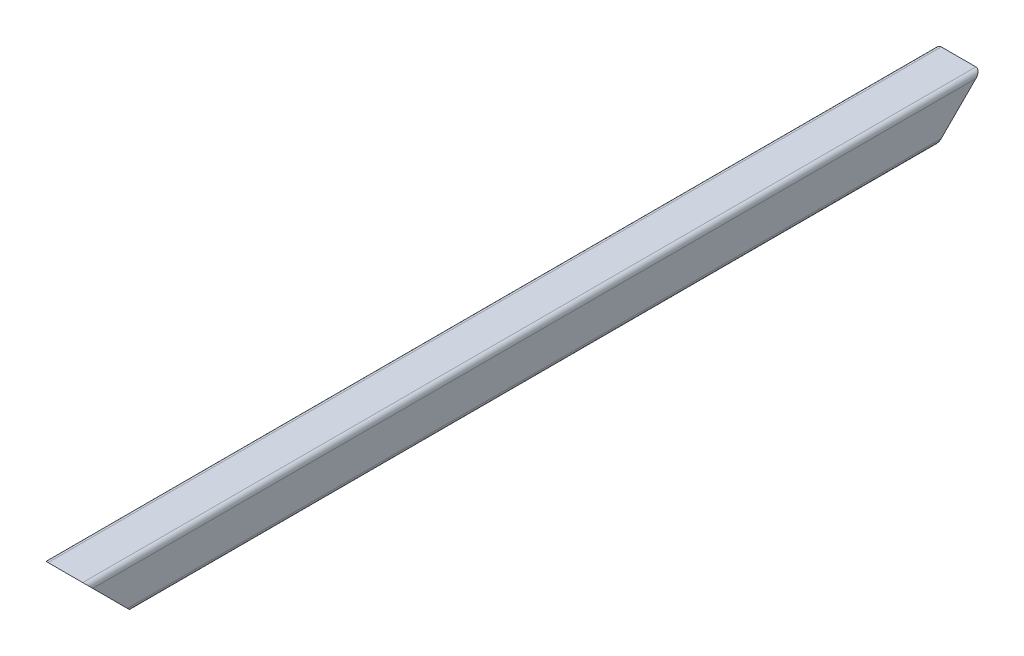
ISO-10303-21;
HEADER;
FILE_DESCRIPTION(('STEP AP214'),'2;1');
FILE_NAME('part.step','',(''),(''),'','','');
FILE_SCHEMA(('AUTOMOTIVE_DESIGN { 1 0 10303 214 1 1 1 1 }'));
ENDSEC;
DATA;
#1=APPLICATION_CONTEXT('core data for automotive mechanical design processes');
#2=APPLICATION_PROTOCOL_DEFINITION('international standard','automotive_design',2000,#1);
#3=PRODUCT_CONTEXT('',#1,'mechanical');
#4=PRODUCT('Part','Part','',(#3));
#5=PRODUCT_RELATED_PRODUCT_CATEGORY('part','',(#4));
#6=PRODUCT_DEFINITION_FORMATION('','',#4);
#7=PRODUCT_DEFINITION_CONTEXT('part definition',#1,'design');
#8=PRODUCT_DEFINITION('design','',#6,#7);
#9=PRODUCT_DEFINITION_SHAPE('','',#8);
#10=(LENGTH_UNIT() NAMED_UNIT(*) SI_UNIT(.MILLI.,.METRE.));
#11=(NAMED_UNIT(*) PLANE_ANGLE_UNIT() SI_UNIT($,.RADIAN.));
#12=(NAMED_UNIT(*) SI_UNIT($,.STERADIAN.) SOLID_ANGLE_UNIT());
#13=UNCERTAINTY_MEASURE_WITH_UNIT(LENGTH_MEASURE(1.E-05),#10,'distance_accuracy_value','');
#14=(GEOMETRIC_REPRESENTATION_CONTEXT(3) GLOBAL_UNCERTAINTY_ASSIGNED_CONTEXT((#13)) GLOBAL_UNIT_ASSIGNED_CONTEXT((#10,
#11,#12)) REPRESENTATION_CONTEXT('',''));
#15=CARTESIAN_POINT('',(0.,0.,0.));
#16=DIRECTION('',(0.,0.,1.));
#17=DIRECTION('',(1.,0.,0.));
#18=AXIS2_PLACEMENT_3D('',#15,#16,#17);
#19=CARTESIAN_POINT('',(-15.4999999999997,1444.50000000001,-759.999999999998));
#20=DIRECTION('',(0.,0.,0.999999999999995));
#21=DIRECTION('',(0.999999999999999,0.,0.));
#22=AXIS2_PLACEMENT_3D('',#19,#20,#21);
#23=CYLINDRICAL_SURFACE('',#22,4.5);
#24=CARTESIAN_POINT('',(-15.5,1444.50000000001,-15.4999999999986));
#25=DIRECTION('',(0.,-0.707106781186555,0.707106781186545));
#26=DIRECTION('',(0.,0.707106781186554,0.707106781186544));
#27=AXIS2_PLACEMENT_3D('',#24,#25,#26);
#28=ELLIPSE('',#27,6.36396103067893,4.5);
#29=CARTESIAN_POINT('',(-19.9999999999989,1444.50000000001,-15.4999999999981));
#30=VERTEX_POINT('',#29);
#31=CARTESIAN_POINT('',(-15.4999999999991,1440.00000000001,-19.9999999999986));
#32=VERTEX_POINT('',#31);
#33=EDGE_CURVE('E170',#30,#32,#28,.T.);
#34=ORIENTED_EDGE('',*,*,#33,.F.);
#35=DIRECTION('',(0.,0.,0.999999999999995));
#36=VECTOR('',#35,1.);
#37=CARTESIAN_POINT('',(-19.9999999999998,1444.50000000001,-759.999999999997));
#38=LINE('',#37,#36);
#39=CARTESIAN_POINT('',(-20.0000000000003,1444.50000000002,-744.499999999996));
#40=VERTEX_POINT('',#39);
#41=EDGE_CURVE('E58',#40,#30,#38,.T.);
#42=ORIENTED_EDGE('',*,*,#41,.F.);
#43=CARTESIAN_POINT('',(-15.5000000000002,1444.50000000001,-744.499999999996));
#44=DIRECTION('',(0.,-0.707106781186554,-0.707106781186545));
#45=DIRECTION('',(0.,-0.707106781186555,0.707106781186545));
#46=AXIS2_PLACEMENT_3D('',#43,#44,#45);
#47=ELLIPSE('',#46,6.36396103067893,4.5);
#48=CARTESIAN_POINT('',(-15.4999999999984,1440.00000000001,-739.999999999995));
#49=VERTEX_POINT('',#48);
#50=EDGE_CURVE('E187',#49,#40,#47,.T.);
#51=ORIENTED_EDGE('',*,*,#50,.F.);
#52=DIRECTION('',(0.,0.,0.999999999999995));
#53=VECTOR('',#52,1.);
#54=CARTESIAN_POINT('',(-15.4999999999982,1440.00000000001,-759.999999999996));
#55=LINE('',#54,#53);
#56=EDGE_CURVE('E212',#49,#32,#55,.T.);
#57=ORIENTED_EDGE('',*,*,#56,.T.);
#58=EDGE_LOOP('',(#34,#42,#51,#57));
#59=FACE_BOUND('',#58,.T.);
#60=ADVANCED_FACE('F43',(#59),#23,.T.);
#61=CARTESIAN_POINT('',(-19.9999999999998,1444.50000000001,-759.999999999997));
#62=DIRECTION('',(0.999999999999999,0.,0.));
#63=DIRECTION('',(0.,0.,-0.999999999999995));
#64=AXIS2_PLACEMENT_3D('',#61,#62,#63);
#65=PLANE('',#64);
#66=DIRECTION('',(0.,-0.707106781186554,-0.707106781186544));
#67=VECTOR('',#66,1.);
#68=CARTESIAN_POINT('',(-19.9999999999999,1072.25000000001,-387.749999999997));
#69=LINE('',#68,#67);
#70=CARTESIAN_POINT('',(-20.0000000000011,1475.50000000002,15.5000000000001));
#71=VERTEX_POINT('',#70);
#72=EDGE_CURVE('E265',#71,#30,#69,.T.);
#73=ORIENTED_EDGE('',*,*,#72,.F.);
#74=DIRECTION('',(0.,0.,0.999999999999995));
#75=VECTOR('',#74,1.);
#76=CARTESIAN_POINT('',(-20.0000000000016,1475.50000000001,-759.999999999996));
#77=LINE('',#76,#75);
#78=CARTESIAN_POINT('',(-20.0000000000005,1475.50000000001,-775.499999999998));
#79=VERTEX_POINT('',#78);
#80=EDGE_CURVE('E184',#79,#71,#77,.T.);
#81=ORIENTED_EDGE('',*,*,#80,.F.);
#82=DIRECTION('',(0.,0.707106781186555,-0.707106781186545));
#83=VECTOR('',#82,1.);
#84=CARTESIAN_POINT('',(-20.0000000000004,1452.25000000001,-752.249999999998));
#85=LINE('',#84,#83);
#86=EDGE_CURVE('E335',#40,#79,#85,.T.);
#87=ORIENTED_EDGE('',*,*,#86,.F.);
#88=ORIENTED_EDGE('',*,*,#41,.T.);
#89=EDGE_LOOP('',(#73,#81,#87,#88));
#90=FACE_BOUND('',#89,.T.);
#91=ADVANCED_FACE('F347',(#90),#65,.F.);
#92=CARTESIAN_POINT('',(-15.5000000000013,1475.50000000001,-759.999999999998));
#93=DIRECTION('',(0.,0.,0.999999999999995));
#94=DIRECTION('',(0.999999999999999,0.,0.));
#95=AXIS2_PLACEMENT_3D('',#92,#93,#94);
#96=CYLINDRICAL_SURFACE('',#95,4.5);
#97=CARTESIAN_POINT('',(-15.5000000000002,1475.50000000001,15.5000000000018));
#98=DIRECTION('',(0.,-0.707106781186555,0.707106781186545));
#99=DIRECTION('',(0.,0.707106781186554,0.707106781186544));
#100=AXIS2_PLACEMENT_3D('',#97,#98,#99);
#101=ELLIPSE('',#100,6.36396103067893,4.5);
#102=CARTESIAN_POINT('',(-15.5,1480.00000000001,20.0000000000006));
#103=VERTEX_POINT('',#102);
#104=EDGE_CURVE('E269',#103,#71,#101,.T.);
#105=ORIENTED_EDGE('',*,*,#104,.F.);
#106=DIRECTION('',(0.,0.,0.999999999999995));
#107=VECTOR('',#106,1.);
#108=CARTESIAN_POINT('',(-15.5000000000022,1480.,-759.999999999993));
#109=LINE('',#108,#107);
#110=CARTESIAN_POINT('',(-15.5000000000011,1480.00000000001,-779.999999999994));
#111=VERTEX_POINT('',#110);
#112=EDGE_CURVE('E231',#111,#103,#109,.T.);
#113=ORIENTED_EDGE('',*,*,#112,.F.);
#114=CARTESIAN_POINT('',(-15.5000000000002,1475.50000000001,-775.499999999997));
#115=DIRECTION('',(0.,-0.707106781186554,-0.707106781186545));
#116=DIRECTION('',(0.,-0.707106781186555,0.707106781186545));
#117=AXIS2_PLACEMENT_3D('',#114,#115,#116);
#118=ELLIPSE('',#117,6.36396103067893,4.5);
#119=EDGE_CURVE('E332',#79,#111,#118,.T.);
#120=ORIENTED_EDGE('',*,*,#119,.F.);
#121=ORIENTED_EDGE('',*,*,#80,.T.);
#122=EDGE_LOOP('',(#105,#113,#120,#121));
#123=FACE_BOUND('',#122,.T.);
#124=ADVANCED_FACE('F349',(#123),#96,.T.);
#125=CARTESIAN_POINT('',(-15.5000000000022,1480.,-759.999999999993));
#126=DIRECTION('',(0.,-1.00000000000001,0.));
#127=DIRECTION('',(0.,0.,-0.999999999999995));
#128=AXIS2_PLACEMENT_3D('',#125,#126,#127);
#129=PLANE('',#128);
#130=DIRECTION('',(-0.999999999999999,0.,0.));
#131=VECTOR('',#130,1.);
#132=CARTESIAN_POINT('',(-15.5,1480.00000000001,20.0000000000006));
#133=LINE('',#132,#131);
#134=CARTESIAN_POINT('',(15.5000000000009,1480.00000000001,20.0000000000001));
#135=VERTEX_POINT('',#134);
#136=EDGE_CURVE('E273',#135,#103,#133,.T.);
#137=ORIENTED_EDGE('',*,*,#136,.F.);
#138=DIRECTION('',(0.,0.,0.999999999999995));
#139=VECTOR('',#138,1.);
#140=CARTESIAN_POINT('',(15.4999999999987,1480.00000000001,-759.999999999994));
#141=LINE('',#140,#139);
#142=CARTESIAN_POINT('',(15.499999999998,1480.00000000001,-779.999999999992));
#143=VERTEX_POINT('',#142);
#144=EDGE_CURVE('E227',#143,#135,#141,.T.);
#145=ORIENTED_EDGE('',*,*,#144,.F.);
#146=DIRECTION('',(0.999999999999999,0.,0.));
#147=VECTOR('',#146,1.);
#148=CARTESIAN_POINT('',(-15.5000000000011,1480.00000000001,-779.999999999994));
#149=LINE('',#148,#147);
#150=EDGE_CURVE('E328',#111,#143,#149,.T.);
#151=ORIENTED_EDGE('',*,*,#150,.F.);
#152=ORIENTED_EDGE('',*,*,#112,.T.);
#153=EDGE_LOOP('',(#137,#145,#151,#152));
#154=FACE_BOUND('',#153,.T.);
#155=ADVANCED_FACE('F353',(#154),#129,.F.);
#156=CARTESIAN_POINT('',(15.4999999999969,1475.50000000001,-759.999999999997));
#157=DIRECTION('',(0.,0.,0.999999999999995));
#158=DIRECTION('',(0.999999999999999,0.,0.));
#159=AXIS2_PLACEMENT_3D('',#156,#157,#158);
#160=CYLINDRICAL_SURFACE('',#159,4.5);
#161=CARTESIAN_POINT('',(15.5,1475.50000000001,15.4999999999998));
#162=DIRECTION('',(0.,-0.707106781186555,0.707106781186545));
#163=DIRECTION('',(0.,0.707106781186554,0.707106781186544));
#164=AXIS2_PLACEMENT_3D('',#161,#162,#163);
#165=ELLIPSE('',#164,6.36396103067893,4.5);
#166=CARTESIAN_POINT('',(20.0000000000007,1475.50000000001,15.5000000000005));
#167=VERTEX_POINT('',#166);
#168=EDGE_CURVE('E277',#167,#135,#165,.T.);
#169=ORIENTED_EDGE('',*,*,#168,.F.);
#170=DIRECTION('',(0.,0.,0.999999999999995));
#171=VECTOR('',#170,1.);
#172=CARTESIAN_POINT('',(19.9999999999993,1475.50000000001,-759.999999999998));
#173=LINE('',#172,#171);
#174=CARTESIAN_POINT('',(19.9999999999991,1475.50000000001,-775.499999999996));
#175=VERTEX_POINT('',#174);
#176=EDGE_CURVE('E223',#175,#167,#173,.T.);
#177=ORIENTED_EDGE('',*,*,#176,.F.);
#178=CARTESIAN_POINT('',(15.499999999998,1475.50000000001,-775.499999999998));
#179=DIRECTION('',(0.,-0.707106781186554,-0.707106781186545));
#180=DIRECTION('',(0.,-0.707106781186555,0.707106781186545));
#181=AXIS2_PLACEMENT_3D('',#178,#179,#180);
#182=ELLIPSE('',#181,6.36396103067893,4.5);
#183=EDGE_CURVE('E324',#143,#175,#182,.T.);
#184=ORIENTED_EDGE('',*,*,#183,.F.);
#185=ORIENTED_EDGE('',*,*,#144,.T.);
#186=EDGE_LOOP('',(#169,#177,#184,#185));
#187=FACE_BOUND('',#186,.T.);
#188=ADVANCED_FACE('F355',(#187),#160,.T.);
#189=CARTESIAN_POINT('',(20.,1444.50000000001,-759.999999999996));
#190=DIRECTION('',(-0.999999999999999,0.,0.));
#191=DIRECTION('',(0.,0.,0.999999999999995));
#192=AXIS2_PLACEMENT_3D('',#189,#190,#191);
#193=PLANE('',#192);
#194=DIRECTION('',(0.,0.707106781186554,0.707106781186544));
#195=VECTOR('',#194,1.);
#196=CARTESIAN_POINT('',(20.0000000000003,1072.25000000001,-387.749999999997));
#197=LINE('',#196,#195);
#198=CARTESIAN_POINT('',(20.0000000000007,1444.50000000001,-15.4999999999988));
#199=VERTEX_POINT('',#198);
#200=EDGE_CURVE('E281',#199,#167,#197,.T.);
#201=ORIENTED_EDGE('',*,*,#200,.F.);
#202=DIRECTION('',(0.,0.,0.999999999999995));
#203=VECTOR('',#202,1.);
#204=CARTESIAN_POINT('',(20.,1444.50000000001,-759.999999999996));
#205=LINE('',#204,#203);
#206=CARTESIAN_POINT('',(19.9999999999993,1444.50000000001,-744.499999999995));
#207=VERTEX_POINT('',#206);
#208=EDGE_CURVE('E219',#207,#199,#205,.T.);
#209=ORIENTED_EDGE('',*,*,#208,.F.);
#210=DIRECTION('',(0.,-0.707106781186555,0.707106781186545));
#211=VECTOR('',#210,1.);
#212=CARTESIAN_POINT('',(20.0000000000011,1452.25000000001,-752.249999999995));
#213=LINE('',#212,#211);
#214=EDGE_CURVE('E320',#175,#207,#213,.T.);
#215=ORIENTED_EDGE('',*,*,#214,.F.);
#216=ORIENTED_EDGE('',*,*,#176,.T.);
#217=EDGE_LOOP('',(#201,#209,#215,#216));
#218=FACE_BOUND('',#217,.T.);
#219=ADVANCED_FACE('F359',(#218),#193,.F.);
#220=CARTESIAN_POINT('',(15.5000000000011,1444.50000000001,-759.999999999995));
#221=DIRECTION('',(0.,0.,0.999999999999995));
#222=DIRECTION('',(0.999999999999999,0.,0.));
#223=AXIS2_PLACEMENT_3D('',#220,#221,#222);
#224=CYLINDRICAL_SURFACE('',#223,4.5);
#225=CARTESIAN_POINT('',(15.4999999999999,1444.50000000001,-15.5000000000004));
#226=DIRECTION('',(0.,-0.707106781186555,0.707106781186545));
#227=DIRECTION('',(0.,0.707106781186554,0.707106781186544));
#228=AXIS2_PLACEMENT_3D('',#225,#226,#227);
#229=ELLIPSE('',#228,6.36396103067893,4.5);
#230=CARTESIAN_POINT('',(15.4999999999984,1440.00000000001,-19.9999999999992));
#231=VERTEX_POINT('',#230);
#232=EDGE_CURVE('E285',#231,#199,#229,.T.);
#233=ORIENTED_EDGE('',*,*,#232,.F.);
#234=DIRECTION('',(0.,0.,0.999999999999995));
#235=VECTOR('',#234,1.);
#236=CARTESIAN_POINT('',(15.4999999999993,1440.00000000001,-759.999999999996));
#237=LINE('',#236,#235);
#238=CARTESIAN_POINT('',(15.5000000000004,1440.00000000001,-739.999999999996));
#239=VERTEX_POINT('',#238);
#240=EDGE_CURVE('E215',#239,#231,#237,.T.);
#241=ORIENTED_EDGE('',*,*,#240,.F.);
#242=CARTESIAN_POINT('',(15.5000000000004,1444.50000000001,-744.499999999995));
#243=DIRECTION('',(0.,-0.707106781186554,-0.707106781186545));
#244=DIRECTION('',(0.,-0.707106781186555,0.707106781186545));
#245=AXIS2_PLACEMENT_3D('',#242,#243,#244);
#246=ELLIPSE('',#245,6.36396103067893,4.5);
#247=EDGE_CURVE('E316',#207,#239,#246,.T.);
#248=ORIENTED_EDGE('',*,*,#247,.F.);
#249=ORIENTED_EDGE('',*,*,#208,.T.);
#250=EDGE_LOOP('',(#233,#241,#248,#249));
#251=FACE_BOUND('',#250,.T.);
#252=ADVANCED_FACE('F361',(#251),#224,.T.);
#253=CARTESIAN_POINT('',(-15.4999999999982,1440.00000000001,-759.999999999996));
#254=DIRECTION('',(0.,1.00000000000001,0.));
#255=DIRECTION('',(0.,0.,0.999999999999995));
#256=AXIS2_PLACEMENT_3D('',#253,#254,#255);
#257=PLANE('',#256);
#258=DIRECTION('',(0.999999999999999,0.,0.));
#259=VECTOR('',#258,1.);
#260=CARTESIAN_POINT('',(-15.4999999999991,1440.00000000001,-19.9999999999986));
#261=LINE('',#260,#259);
#262=EDGE_CURVE('E249',#32,#231,#261,.T.);
#263=ORIENTED_EDGE('',*,*,#262,.F.);
#264=ORIENTED_EDGE('',*,*,#56,.F.);
#265=DIRECTION('',(-0.999999999999999,0.,0.));
#266=VECTOR('',#265,1.);
#267=CARTESIAN_POINT('',(-15.4999999999984,1440.00000000001,-739.999999999995));
#268=LINE('',#267,#266);
#269=EDGE_CURVE('E312',#239,#49,#268,.T.);
#270=ORIENTED_EDGE('',*,*,#269,.F.);
#271=ORIENTED_EDGE('',*,*,#240,.T.);
#272=EDGE_LOOP('',(#263,#264,#270,#271));
#273=FACE_BOUND('',#272,.T.);
#274=ADVANCED_FACE('F363',(#273),#257,.F.);
#275=CARTESIAN_POINT('',(-1.11159442390632E-12,1460.00000000001,-759.999999999995));
#276=DIRECTION('',(0.,-0.707106781186554,-0.707106781186545));
#277=DIRECTION('',(0.,0.707106781186555,-0.707106781186545));
#278=AXIS2_PLACEMENT_3D('',#275,#276,#277);
#279=PLANE('',#278);
#280=CARTESIAN_POINT('',(-15.,1445.00000000001,-744.999999999997));
#281=DIRECTION('',(0.,-0.707106781186554,-0.707106781186545));
#282=DIRECTION('',(0.,-0.707106781186555,0.707106781186545));
#283=AXIS2_PLACEMENT_3D('',#280,#281,#282);
#284=ELLIPSE('',#283,4.24264068711928,3.);
#285=CARTESIAN_POINT('',(-14.9999999999998,1442.00000000001,-741.999999999996));
#286=VERTEX_POINT('',#285);
#287=CARTESIAN_POINT('',(-18.0000000000004,1445.00000000001,-744.999999999998));
#288=VERTEX_POINT('',#287);
#289=EDGE_CURVE('E175',#286,#288,#284,.T.);
#290=ORIENTED_EDGE('',*,*,#289,.F.);
#291=DIRECTION('',(-0.999999999999999,0.,0.));
#292=VECTOR('',#291,1.);
#293=CARTESIAN_POINT('',(-14.9999999999998,1442.00000000001,-741.999999999996));
#294=LINE('',#293,#292);
#295=CARTESIAN_POINT('',(15.,1442.00000000001,-741.999999999996));
#296=VERTEX_POINT('',#295);
#297=EDGE_CURVE('E306',#296,#286,#294,.T.);
#298=ORIENTED_EDGE('',*,*,#297,.F.);
#299=CARTESIAN_POINT('',(15.0000000000003,1445.00000000001,-744.999999999997));
#300=DIRECTION('',(0.,-0.707106781186554,-0.707106781186545));
#301=DIRECTION('',(0.,-0.707106781186555,0.707106781186545));
#302=AXIS2_PLACEMENT_3D('',#299,#300,#301);
#303=ELLIPSE('',#302,4.24264068711928,3.);
#304=CARTESIAN_POINT('',(18.0000000000019,1445.00000000001,-744.999999999997));
#305=VERTEX_POINT('',#304);
#306=EDGE_CURVE('E302',#305,#296,#303,.T.);
#307=ORIENTED_EDGE('',*,*,#306,.F.);
#308=DIRECTION('',(0.,-0.707106781186555,0.707106781186545));
#309=VECTOR('',#308,1.);
#310=CARTESIAN_POINT('',(17.9999999999995,1452.50000000001,-752.499999999995));
#311=LINE('',#310,#309);
#312=CARTESIAN_POINT('',(18.0000000000002,1475.00000000001,-774.999999999997));
#313=VERTEX_POINT('',#312);
#314=EDGE_CURVE('E298',#313,#305,#311,.T.);
#315=ORIENTED_EDGE('',*,*,#314,.F.);
#316=CARTESIAN_POINT('',(14.9999999999969,1475.00000000001,-774.999999999996));
#317=DIRECTION('',(0.,-0.707106781186554,-0.707106781186545));
#318=DIRECTION('',(0.,-0.707106781186555,0.707106781186545));
#319=AXIS2_PLACEMENT_3D('',#316,#317,#318);
#320=ELLIPSE('',#319,4.24264068711928,3.);
#321=CARTESIAN_POINT('',(14.9999999999987,1478.00000000001,-777.999999999995));
#322=VERTEX_POINT('',#321);
#323=EDGE_CURVE('E294',#322,#313,#320,.T.);
#324=ORIENTED_EDGE('',*,*,#323,.F.);
#325=DIRECTION('',(0.999999999999999,0.,0.));
#326=VECTOR('',#325,1.);
#327=CARTESIAN_POINT('',(-15.,1478.00000000001,-777.999999999994));
#328=LINE('',#327,#326);
#329=CARTESIAN_POINT('',(-15.,1478.00000000001,-777.999999999994));
#330=VERTEX_POINT('',#329);
#331=EDGE_CURVE('E245',#330,#322,#328,.T.);
#332=ORIENTED_EDGE('',*,*,#331,.F.);
#333=CARTESIAN_POINT('',(-15.,1475.00000000001,-774.999999999996));
#334=DIRECTION('',(0.,-0.707106781186554,-0.707106781186545));
#335=DIRECTION('',(0.,-0.707106781186555,0.707106781186545));
#336=AXIS2_PLACEMENT_3D('',#333,#334,#335);
#337=ELLIPSE('',#336,4.24264068711928,3.);
#338=CARTESIAN_POINT('',(-18.0000000000021,1475.00000000001,-774.999999999998));
#339=VERTEX_POINT('',#338);
#340=EDGE_CURVE('E243',#339,#330,#337,.T.);
#341=ORIENTED_EDGE('',*,*,#340,.F.);
#342=DIRECTION('',(0.,0.707106781186555,-0.707106781186545));
#343=VECTOR('',#342,1.);
#344=CARTESIAN_POINT('',(-17.9999999999986,1452.50000000001,-752.499999999995));
#345=LINE('',#344,#343);
#346=EDGE_CURVE('E51',#288,#339,#345,.T.);
#347=ORIENTED_EDGE('',*,*,#346,.F.);
#348=EDGE_LOOP('',(#290,#298,#307,#315,#324,#332,#341,#347));
#349=FACE_BOUND('',#348,.T.);
#350=ORIENTED_EDGE('',*,*,#269,.T.);
#351=ORIENTED_EDGE('',*,*,#50,.T.);
#352=ORIENTED_EDGE('',*,*,#86,.T.);
#353=ORIENTED_EDGE('',*,*,#119,.T.);
#354=ORIENTED_EDGE('',*,*,#150,.T.);
#355=ORIENTED_EDGE('',*,*,#183,.T.);
#356=ORIENTED_EDGE('',*,*,#214,.T.);
#357=ORIENTED_EDGE('',*,*,#247,.T.);
#358=EDGE_LOOP('',(#350,#351,#352,#353,#354,#355,#356,#357));
#359=FACE_BOUND('',#358,.T.);
#360=ADVANCED_FACE('F240',(#349,#359),#279,.T.);
#361=CARTESIAN_POINT('',(-15.0000000000005,1445.00000000001,-759.999999999997));
#362=DIRECTION('',(0.,0.,0.999999999999995));
#363=DIRECTION('',(0.999999999999999,0.,0.));
#364=AXIS2_PLACEMENT_3D('',#361,#362,#363);
#365=CYLINDRICAL_SURFACE('',#364,3.);
#366=DIRECTION('',(0.,0.,0.999999999999995));
#367=VECTOR('',#366,1.);
#368=CARTESIAN_POINT('',(-17.9999999999999,1445.00000000001,-759.999999999997));
#369=LINE('',#368,#367);
#370=CARTESIAN_POINT('',(-17.9999999999997,1445.00000000001,-14.9999999999985));
#371=VERTEX_POINT('',#370);
#372=EDGE_CURVE('E165',#288,#371,#369,.T.);
#373=ORIENTED_EDGE('',*,*,#372,.T.);
#374=CARTESIAN_POINT('',(-14.9999999999989,1445.00000000001,-15.));
#375=DIRECTION('',(0.,-0.707106781186555,0.707106781186545));
#376=DIRECTION('',(0.,0.707106781186554,0.707106781186544));
#377=AXIS2_PLACEMENT_3D('',#374,#375,#376);
#378=ELLIPSE('',#377,4.24264068711928,3.);
#379=CARTESIAN_POINT('',(-14.9999999999996,1442.00000000001,-17.999999999998));
#380=VERTEX_POINT('',#379);
#381=EDGE_CURVE('E11',#371,#380,#378,.T.);
#382=ORIENTED_EDGE('',*,*,#381,.T.);
#383=DIRECTION('',(0.,0.,0.999999999999995));
#384=VECTOR('',#383,1.);
#385=CARTESIAN_POINT('',(-15.0000000000013,1442.00000000001,-759.999999999994));
#386=LINE('',#385,#384);
#387=EDGE_CURVE('E209',#286,#380,#386,.T.);
#388=ORIENTED_EDGE('',*,*,#387,.F.);
#389=ORIENTED_EDGE('',*,*,#289,.T.);
#390=EDGE_LOOP('',(#373,#382,#388,#389));
#391=FACE_BOUND('',#390,.T.);
#392=ADVANCED_FACE('F174',(#391),#365,.F.);
#393=CARTESIAN_POINT('',(-15.0000000000013,1442.00000000001,-759.999999999994));
#394=DIRECTION('',(0.,1.00000000000001,0.));
#395=DIRECTION('',(0.,0.,0.999999999999995));
#396=AXIS2_PLACEMENT_3D('',#393,#394,#395);
#397=PLANE('',#396);
#398=ORIENTED_EDGE('',*,*,#387,.T.);
#399=DIRECTION('',(0.999999999999999,0.,0.));
#400=VECTOR('',#399,1.);
#401=CARTESIAN_POINT('',(-14.9999999999996,1442.00000000001,-17.999999999998));
#402=LINE('',#401,#400);
#403=CARTESIAN_POINT('',(15.0000000000009,1442.00000000001,-18.0000000000005));
#404=VERTEX_POINT('',#403);
#405=EDGE_CURVE('E66',#380,#404,#402,.T.);
#406=ORIENTED_EDGE('',*,*,#405,.T.);
#407=DIRECTION('',(0.,0.,0.999999999999995));
#408=VECTOR('',#407,1.);
#409=CARTESIAN_POINT('',(14.9999999999998,1442.00000000001,-759.999999999995));
#410=LINE('',#409,#408);
#411=EDGE_CURVE('E205',#296,#404,#410,.T.);
#412=ORIENTED_EDGE('',*,*,#411,.F.);
#413=ORIENTED_EDGE('',*,*,#297,.T.);
#414=EDGE_LOOP('',(#398,#406,#412,#413));
#415=FACE_BOUND('',#414,.T.);
#416=ADVANCED_FACE('F422',(#415),#397,.T.);
#417=CARTESIAN_POINT('',(15.0000000000009,1445.00000000001,-759.999999999996));
#418=DIRECTION('',(0.,0.,0.999999999999995));
#419=DIRECTION('',(0.999999999999999,0.,0.));
#420=AXIS2_PLACEMENT_3D('',#417,#418,#419);
#421=CYLINDRICAL_SURFACE('',#420,3.);
#422=ORIENTED_EDGE('',*,*,#411,.T.);
#423=CARTESIAN_POINT('',(14.9999999999987,1445.00000000001,-14.9999999999979));
#424=DIRECTION('',(0.,-0.707106781186555,0.707106781186545));
#425=DIRECTION('',(0.,0.707106781186554,0.707106781186544));
#426=AXIS2_PLACEMENT_3D('',#423,#424,#425);
#427=ELLIPSE('',#426,4.24264068711928,3.);
#428=CARTESIAN_POINT('',(18.,1445.00000000001,-14.9999999999993));
#429=VERTEX_POINT('',#428);
#430=EDGE_CURVE('E488',#404,#429,#427,.T.);
#431=ORIENTED_EDGE('',*,*,#430,.T.);
#432=DIRECTION('',(0.,0.,0.999999999999995));
#433=VECTOR('',#432,1.);
#434=CARTESIAN_POINT('',(18.0000000000015,1445.00000000001,-759.999999999995));
#435=LINE('',#434,#433);
#436=EDGE_CURVE('E201',#305,#429,#435,.T.);
#437=ORIENTED_EDGE('',*,*,#436,.F.);
#438=ORIENTED_EDGE('',*,*,#306,.T.);
#439=EDGE_LOOP('',(#422,#431,#437,#438));
#440=FACE_BOUND('',#439,.T.);
#441=ADVANCED_FACE('F428',(#440),#421,.F.);
#442=CARTESIAN_POINT('',(18.0000000000015,1445.00000000001,-759.999999999995));
#443=DIRECTION('',(-0.999999999999999,0.,0.));
#444=DIRECTION('',(0.,0.,0.999999999999995));
#445=AXIS2_PLACEMENT_3D('',#442,#443,#444);
#446=PLANE('',#445);
#447=ORIENTED_EDGE('',*,*,#436,.T.);
#448=DIRECTION('',(0.,0.707106781186554,0.707106781186544));
#449=VECTOR('',#448,1.);
#450=CARTESIAN_POINT('',(17.9999999999975,1072.50000000001,-387.499999999996));
#451=LINE('',#450,#449);
#452=CARTESIAN_POINT('',(17.9999999999997,1475.00000000001,15.0000000000011));
#453=VERTEX_POINT('',#452);
#454=EDGE_CURVE('E485',#429,#453,#451,.T.);
#455=ORIENTED_EDGE('',*,*,#454,.T.);
#456=DIRECTION('',(0.,0.,0.999999999999995));
#457=VECTOR('',#456,1.);
#458=CARTESIAN_POINT('',(17.9999999999973,1475.00000000001,-759.999999999996));
#459=LINE('',#458,#457);
#460=EDGE_CURVE('E197',#313,#453,#459,.T.);
#461=ORIENTED_EDGE('',*,*,#460,.F.);
#462=ORIENTED_EDGE('',*,*,#314,.T.);
#463=EDGE_LOOP('',(#447,#455,#461,#462));
#464=FACE_BOUND('',#463,.T.);
#465=ADVANCED_FACE('F436',(#464),#446,.T.);
#466=CARTESIAN_POINT('',(14.9999999999985,1475.00000000001,-759.999999999998));
#467=DIRECTION('',(0.,0.,0.999999999999995));
#468=DIRECTION('',(0.999999999999999,0.,0.));
#469=AXIS2_PLACEMENT_3D('',#466,#467,#468);
#470=CYLINDRICAL_SURFACE('',#469,3.);
#471=ORIENTED_EDGE('',*,*,#460,.T.);
#472=CARTESIAN_POINT('',(15.0000000000007,1475.00000000001,15.0000000000016));
#473=DIRECTION('',(0.,-0.707106781186555,0.707106781186545));
#474=DIRECTION('',(0.,0.707106781186554,0.707106781186544));
#475=AXIS2_PLACEMENT_3D('',#472,#473,#474);
#476=ELLIPSE('',#475,4.24264068711928,3.);
#477=CARTESIAN_POINT('',(14.9999999999996,1478.00000000001,18.0000000000001));
#478=VERTEX_POINT('',#477);
#479=EDGE_CURVE('E258',#453,#478,#476,.T.);
#480=ORIENTED_EDGE('',*,*,#479,.T.);
#481=DIRECTION('',(0.,0.,0.999999999999995));
#482=VECTOR('',#481,1.);
#483=CARTESIAN_POINT('',(14.9999999999978,1478.,-759.999999999993));
#484=LINE('',#483,#482);
#485=EDGE_CURVE('E193',#322,#478,#484,.T.);
#486=ORIENTED_EDGE('',*,*,#485,.F.);
#487=ORIENTED_EDGE('',*,*,#323,.T.);
#488=EDGE_LOOP('',(#471,#480,#486,#487));
#489=FACE_BOUND('',#488,.T.);
#490=ADVANCED_FACE('F444',(#489),#470,.F.);
#491=CARTESIAN_POINT('',(-15.0000000000022,1478.00000000001,-759.999999999994));
#492=DIRECTION('',(0.,-1.00000000000001,0.));
#493=DIRECTION('',(0.,0.,-0.999999999999995));
#494=AXIS2_PLACEMENT_3D('',#491,#492,#493);
#495=PLANE('',#494);
#496=ORIENTED_EDGE('',*,*,#485,.T.);
#497=DIRECTION('',(-0.999999999999999,0.,0.));
#498=VECTOR('',#497,1.);
#499=CARTESIAN_POINT('',(-15.0000000000007,1478.00000000001,18.0000000000008));
#500=LINE('',#499,#498);
#501=CARTESIAN_POINT('',(-15.0000000000007,1478.00000000001,18.0000000000008));
#502=VERTEX_POINT('',#501);
#503=EDGE_CURVE('E254',#478,#502,#500,.T.);
#504=ORIENTED_EDGE('',*,*,#503,.T.);
#505=DIRECTION('',(0.,0.,0.999999999999995));
#506=VECTOR('',#505,1.);
#507=CARTESIAN_POINT('',(-15.0000000000022,1478.00000000001,-759.999999999994));
#508=LINE('',#507,#506);
#509=EDGE_CURVE('E182',#330,#502,#508,.T.);
#510=ORIENTED_EDGE('',*,*,#509,.F.);
#511=ORIENTED_EDGE('',*,*,#331,.T.);
#512=EDGE_LOOP('',(#496,#504,#510,#511));
#513=FACE_BOUND('',#512,.T.);
#514=ADVANCED_FACE('F452',(#513),#495,.T.);
#515=CARTESIAN_POINT('',(-15.0000000000007,1475.00000000001,-759.999999999997));
#516=DIRECTION('',(0.,0.,0.999999999999995));
#517=DIRECTION('',(0.999999999999999,0.,0.));
#518=AXIS2_PLACEMENT_3D('',#515,#516,#517);
#519=CYLINDRICAL_SURFACE('',#518,3.);
#520=ORIENTED_EDGE('',*,*,#509,.T.);
#521=CARTESIAN_POINT('',(-15.0000000000009,1475.00000000002,14.9999999999996));
#522=DIRECTION('',(0.,-0.707106781186555,0.707106781186545));
#523=DIRECTION('',(0.,0.707106781186554,0.707106781186544));
#524=AXIS2_PLACEMENT_3D('',#521,#522,#523);
#525=ELLIPSE('',#524,4.24264068711928,3.);
#526=CARTESIAN_POINT('',(-17.9999999999997,1475.00000000001,14.9999999999997));
#527=VERTEX_POINT('',#526);
#528=EDGE_CURVE('E171',#502,#527,#525,.T.);
#529=ORIENTED_EDGE('',*,*,#528,.T.);
#530=DIRECTION('',(0.,0.,0.999999999999995));
#531=VECTOR('',#530,1.);
#532=CARTESIAN_POINT('',(-18.0000000000008,1475.00000000001,-759.999999999998));
#533=LINE('',#532,#531);
#534=EDGE_CURVE('E167',#339,#527,#533,.T.);
#535=ORIENTED_EDGE('',*,*,#534,.F.);
#536=ORIENTED_EDGE('',*,*,#340,.T.);
#537=EDGE_LOOP('',(#520,#529,#535,#536));
#538=FACE_BOUND('',#537,.T.);
#539=ADVANCED_FACE('F251',(#538),#519,.F.);
#540=CARTESIAN_POINT('',(-17.9999999999999,1445.00000000001,-759.999999999997));
#541=DIRECTION('',(0.999999999999999,0.,0.));
#542=DIRECTION('',(0.,0.,-0.999999999999995));
#543=AXIS2_PLACEMENT_3D('',#540,#541,#542);
#544=PLANE('',#543);
#545=ORIENTED_EDGE('',*,*,#534,.T.);
#546=DIRECTION('',(0.,-0.707106781186554,-0.707106781186544));
#547=VECTOR('',#546,1.);
#548=CARTESIAN_POINT('',(-18.0000000000011,1072.50000000001,-387.499999999995));
#549=LINE('',#548,#547);
#550=EDGE_CURVE('E156',#527,#371,#549,.T.);
#551=ORIENTED_EDGE('',*,*,#550,.T.);
#552=ORIENTED_EDGE('',*,*,#372,.F.);
#553=ORIENTED_EDGE('',*,*,#346,.T.);
#554=EDGE_LOOP('',(#545,#551,#552,#553));
#555=FACE_BOUND('',#554,.T.);
#556=ADVANCED_FACE('F163',(#555),#544,.T.);
#557=CARTESIAN_POINT('',(-1.55627578919585E-12,1460.00000000002,7.7715611723761E-13));
#558=DIRECTION('',(0.,-0.707106781186555,0.707106781186545));
#559=DIRECTION('',(0.,-0.707106781186554,-0.707106781186544));
#560=AXIS2_PLACEMENT_3D('',#557,#558,#559);
#561=PLANE('',#560);
#562=ORIENTED_EDGE('',*,*,#550,.F.);
#563=ORIENTED_EDGE('',*,*,#528,.F.);
#564=ORIENTED_EDGE('',*,*,#503,.F.);
#565=ORIENTED_EDGE('',*,*,#479,.F.);
#566=ORIENTED_EDGE('',*,*,#454,.F.);
#567=ORIENTED_EDGE('',*,*,#430,.F.);
#568=ORIENTED_EDGE('',*,*,#405,.F.);
#569=ORIENTED_EDGE('',*,*,#381,.F.);
#570=EDGE_LOOP('',(#562,#563,#564,#565,#566,#567,#568,#569));
#571=FACE_BOUND('',#570,.T.);
#572=ORIENTED_EDGE('',*,*,#33,.T.);
#573=ORIENTED_EDGE('',*,*,#262,.T.);
#574=ORIENTED_EDGE('',*,*,#232,.T.);
#575=ORIENTED_EDGE('',*,*,#200,.T.);
#576=ORIENTED_EDGE('',*,*,#168,.T.);
#577=ORIENTED_EDGE('',*,*,#136,.T.);
#578=ORIENTED_EDGE('',*,*,#104,.T.);
#579=ORIENTED_EDGE('',*,*,#72,.T.);
#580=EDGE_LOOP('',(#572,#573,#574,#575,#576,#577,#578,#579));
#581=FACE_BOUND('',#580,.T.);
#582=ADVANCED_FACE('F154',(#571,#581),#561,.T.);
#583=CLOSED_SHELL('',(#60,#91,#124,#155,#188,#219,#252,#274,#360,#392,#416,#441,#465,#490,#514,
#539,#556,#582));
#584=MANIFOLD_SOLID_BREP('B2',#583);
#585=ADVANCED_BREP_SHAPE_REPRESENTATION('',(#18,#584),#14);
#586=SHAPE_DEFINITION_REPRESENTATION(#9,#585);
ENDSEC;
END-ISO-10303-21;
